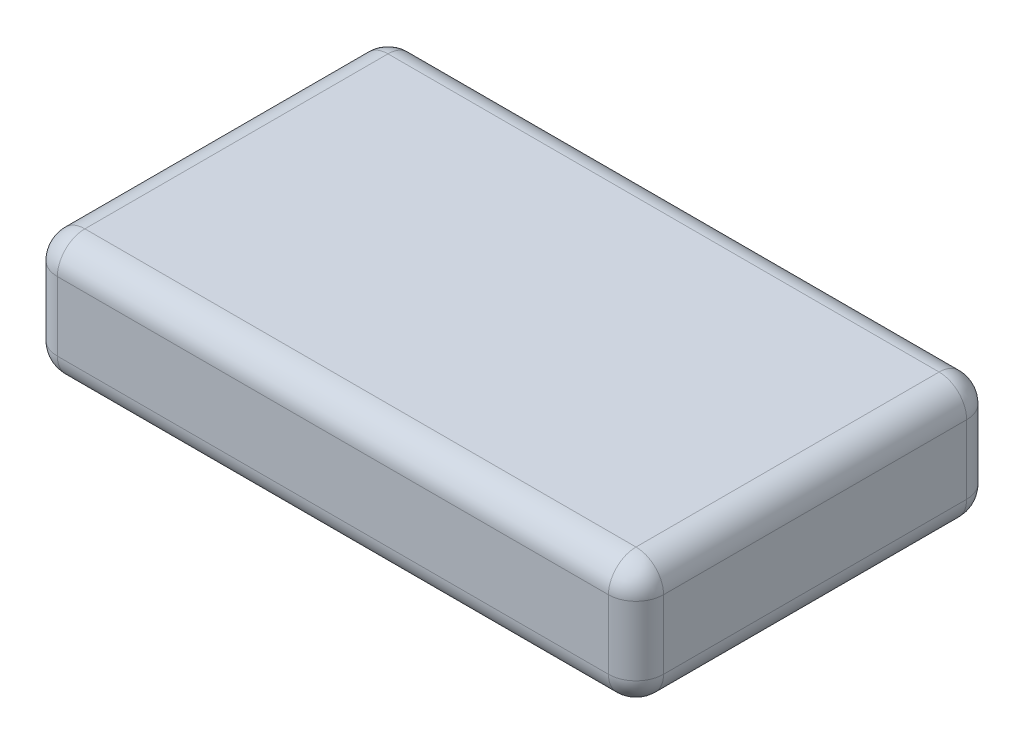
ISO-10303-21;
HEADER;
FILE_DESCRIPTION(('STEP AP214'),'2;1');
FILE_NAME('part.step','',(''),(''),'','','');
FILE_SCHEMA(('AUTOMOTIVE_DESIGN { 1 0 10303 214 1 1 1 1 }'));
ENDSEC;
DATA;
#1=APPLICATION_CONTEXT('core data for automotive mechanical design processes');
#2=APPLICATION_PROTOCOL_DEFINITION('international standard','automotive_design',2000,#1);
#3=PRODUCT_CONTEXT('',#1,'mechanical');
#4=PRODUCT('Part','Part','',(#3));
#5=PRODUCT_RELATED_PRODUCT_CATEGORY('part','',(#4));
#6=PRODUCT_DEFINITION_FORMATION('','',#4);
#7=PRODUCT_DEFINITION_CONTEXT('part definition',#1,'design');
#8=PRODUCT_DEFINITION('design','',#6,#7);
#9=PRODUCT_DEFINITION_SHAPE('','',#8);
#10=(LENGTH_UNIT() NAMED_UNIT(*) SI_UNIT(.MILLI.,.METRE.));
#11=(NAMED_UNIT(*) PLANE_ANGLE_UNIT() SI_UNIT($,.RADIAN.));
#12=(NAMED_UNIT(*) SI_UNIT($,.STERADIAN.) SOLID_ANGLE_UNIT());
#13=UNCERTAINTY_MEASURE_WITH_UNIT(LENGTH_MEASURE(1.E-05),#10,'distance_accuracy_value','');
#14=(GEOMETRIC_REPRESENTATION_CONTEXT(3) GLOBAL_UNCERTAINTY_ASSIGNED_CONTEXT((#13)) GLOBAL_UNIT_ASSIGNED_CONTEXT((#10,
#11,#12)) REPRESENTATION_CONTEXT('',''));
#15=CARTESIAN_POINT('',(0.,0.,0.));
#16=DIRECTION('',(0.,0.,1.));
#17=DIRECTION('',(1.,0.,0.));
#18=AXIS2_PLACEMENT_3D('',#15,#16,#17);
#19=CARTESIAN_POINT('',(-22.,9.,-13.));
#20=DIRECTION('',(1.,0.,0.));
#21=DIRECTION('',(0.,0.,-1.));
#22=AXIS2_PLACEMENT_3D('',#19,#20,#21);
#23=PLANE('',#22);
#24=DIRECTION('',(0.,-1.,0.));
#25=VECTOR('',#24,1.);
#26=CARTESIAN_POINT('',(-22.,9.,-11.));
#27=LINE('',#26,#25);
#28=CARTESIAN_POINT('',(-22.,7.,-11.));
#29=VERTEX_POINT('',#28);
#30=CARTESIAN_POINT('',(-22.,2.,-11.));
#31=VERTEX_POINT('',#30);
#32=EDGE_CURVE('E236',#29,#31,#27,.T.);
#33=ORIENTED_EDGE('',*,*,#32,.T.);
#34=DIRECTION('',(0.,0.,1.));
#35=VECTOR('',#34,1.);
#36=CARTESIAN_POINT('',(-22.,2.,13.));
#37=LINE('',#36,#35);
#38=CARTESIAN_POINT('',(-22.,2.,11.));
#39=VERTEX_POINT('',#38);
#40=EDGE_CURVE('E238',#31,#39,#37,.T.);
#41=ORIENTED_EDGE('',*,*,#40,.T.);
#42=DIRECTION('',(0.,-1.,0.));
#43=VECTOR('',#42,1.);
#44=CARTESIAN_POINT('',(-22.,9.,11.));
#45=LINE('',#44,#43);
#46=CARTESIAN_POINT('',(-22.,7.,11.));
#47=VERTEX_POINT('',#46);
#48=EDGE_CURVE('E219',#39,#47,#45,.F.);
#49=ORIENTED_EDGE('',*,*,#48,.T.);
#50=DIRECTION('',(0.,0.,1.));
#51=VECTOR('',#50,1.);
#52=CARTESIAN_POINT('',(-22.,7.,-13.));
#53=LINE('',#52,#51);
#54=EDGE_CURVE('E228',#47,#29,#53,.F.);
#55=ORIENTED_EDGE('',*,*,#54,.T.);
#56=EDGE_LOOP('',(#33,#41,#49,#55));
#57=FACE_BOUND('',#56,.T.);
#58=ADVANCED_FACE('F42',(#57),#23,.F.);
#59=CARTESIAN_POINT('',(22.,9.,13.));
#60=DIRECTION('',(0.,0.,-1.));
#61=DIRECTION('',(-1.,0.,0.));
#62=AXIS2_PLACEMENT_3D('',#59,#60,#61);
#63=PLANE('',#62);
#64=DIRECTION('',(0.,-1.,0.));
#65=VECTOR('',#64,1.);
#66=CARTESIAN_POINT('',(-20.,9.,13.));
#67=LINE('',#66,#65);
#68=CARTESIAN_POINT('',(-20.,7.,13.));
#69=VERTEX_POINT('',#68);
#70=CARTESIAN_POINT('',(-20.,2.,13.));
#71=VERTEX_POINT('',#70);
#72=EDGE_CURVE('E221',#69,#71,#67,.T.);
#73=ORIENTED_EDGE('',*,*,#72,.T.);
#74=DIRECTION('',(1.,0.,0.));
#75=VECTOR('',#74,1.);
#76=CARTESIAN_POINT('',(22.,2.,13.));
#77=LINE('',#76,#75);
#78=CARTESIAN_POINT('',(20.,2.,13.));
#79=VERTEX_POINT('',#78);
#80=EDGE_CURVE('E225',#71,#79,#77,.T.);
#81=ORIENTED_EDGE('',*,*,#80,.T.);
#82=DIRECTION('',(0.,-1.,0.));
#83=VECTOR('',#82,1.);
#84=CARTESIAN_POINT('',(20.,9.,13.));
#85=LINE('',#84,#83);
#86=CARTESIAN_POINT('',(20.,7.,13.));
#87=VERTEX_POINT('',#86);
#88=EDGE_CURVE('E226',#79,#87,#85,.F.);
#89=ORIENTED_EDGE('',*,*,#88,.T.);
#90=DIRECTION('',(1.,0.,0.));
#91=VECTOR('',#90,1.);
#92=CARTESIAN_POINT('',(22.,7.,13.));
#93=LINE('',#92,#91);
#94=EDGE_CURVE('E230',#87,#69,#93,.F.);
#95=ORIENTED_EDGE('',*,*,#94,.T.);
#96=EDGE_LOOP('',(#73,#81,#89,#95));
#97=FACE_BOUND('',#96,.T.);
#98=ADVANCED_FACE('F298',(#97),#63,.F.);
#99=CARTESIAN_POINT('',(22.,9.,-13.));
#100=DIRECTION('',(-1.,0.,0.));
#101=DIRECTION('',(0.,0.,1.));
#102=AXIS2_PLACEMENT_3D('',#99,#100,#101);
#103=PLANE('',#102);
#104=DIRECTION('',(0.,-1.,0.));
#105=VECTOR('',#104,1.);
#106=CARTESIAN_POINT('',(22.,9.,11.));
#107=LINE('',#106,#105);
#108=CARTESIAN_POINT('',(22.,7.,11.));
#109=VERTEX_POINT('',#108);
#110=CARTESIAN_POINT('',(22.,2.,11.));
#111=VERTEX_POINT('',#110);
#112=EDGE_CURVE('E144',#109,#111,#107,.T.);
#113=ORIENTED_EDGE('',*,*,#112,.T.);
#114=DIRECTION('',(0.,0.,-1.));
#115=VECTOR('',#114,1.);
#116=CARTESIAN_POINT('',(22.,2.,-13.));
#117=LINE('',#116,#115);
#118=CARTESIAN_POINT('',(22.,2.,-11.));
#119=VERTEX_POINT('',#118);
#120=EDGE_CURVE('E140',#111,#119,#117,.T.);
#121=ORIENTED_EDGE('',*,*,#120,.T.);
#122=DIRECTION('',(0.,-1.,0.));
#123=VECTOR('',#122,1.);
#124=CARTESIAN_POINT('',(22.,9.,-11.));
#125=LINE('',#124,#123);
#126=CARTESIAN_POINT('',(22.,7.,-11.));
#127=VERTEX_POINT('',#126);
#128=EDGE_CURVE('E134',#119,#127,#125,.F.);
#129=ORIENTED_EDGE('',*,*,#128,.T.);
#130=DIRECTION('',(0.,0.,-1.));
#131=VECTOR('',#130,1.);
#132=CARTESIAN_POINT('',(22.,7.,-13.));
#133=LINE('',#132,#131);
#134=EDGE_CURVE('E137',#127,#109,#133,.F.);
#135=ORIENTED_EDGE('',*,*,#134,.T.);
#136=EDGE_LOOP('',(#113,#121,#129,#135));
#137=FACE_BOUND('',#136,.T.);
#138=ADVANCED_FACE('F136',(#137),#103,.F.);
#139=CARTESIAN_POINT('',(22.,9.,-13.));
#140=DIRECTION('',(0.,0.,1.));
#141=DIRECTION('',(1.,0.,0.));
#142=AXIS2_PLACEMENT_3D('',#139,#140,#141);
#143=PLANE('',#142);
#144=DIRECTION('',(0.,-1.,0.));
#145=VECTOR('',#144,1.);
#146=CARTESIAN_POINT('',(20.,9.,-13.));
#147=LINE('',#146,#145);
#148=CARTESIAN_POINT('',(20.,7.,-13.));
#149=VERTEX_POINT('',#148);
#150=CARTESIAN_POINT('',(20.,2.,-13.));
#151=VERTEX_POINT('',#150);
#152=EDGE_CURVE('E159',#149,#151,#147,.T.);
#153=ORIENTED_EDGE('',*,*,#152,.T.);
#154=DIRECTION('',(-1.,0.,0.));
#155=VECTOR('',#154,1.);
#156=CARTESIAN_POINT('',(-22.,2.,-13.));
#157=LINE('',#156,#155);
#158=CARTESIAN_POINT('',(-20.,2.,-13.));
#159=VERTEX_POINT('',#158);
#160=EDGE_CURVE('E245',#151,#159,#157,.T.);
#161=ORIENTED_EDGE('',*,*,#160,.T.);
#162=DIRECTION('',(0.,-1.,0.));
#163=VECTOR('',#162,1.);
#164=CARTESIAN_POINT('',(-20.,9.,-13.));
#165=LINE('',#164,#163);
#166=CARTESIAN_POINT('',(-20.,7.,-13.));
#167=VERTEX_POINT('',#166);
#168=EDGE_CURVE('E243',#159,#167,#165,.F.);
#169=ORIENTED_EDGE('',*,*,#168,.T.);
#170=DIRECTION('',(-1.,0.,0.));
#171=VECTOR('',#170,1.);
#172=CARTESIAN_POINT('',(22.,7.,-13.));
#173=LINE('',#172,#171);
#174=EDGE_CURVE('E240',#167,#149,#173,.F.);
#175=ORIENTED_EDGE('',*,*,#174,.T.);
#176=EDGE_LOOP('',(#153,#161,#169,#175));
#177=FACE_BOUND('',#176,.T.);
#178=ADVANCED_FACE('F305',(#177),#143,.F.);
#179=CARTESIAN_POINT('',(0.,9.,0.));
#180=DIRECTION('',(0.,-1.,0.));
#181=DIRECTION('',(0.,0.,-1.));
#182=AXIS2_PLACEMENT_3D('',#179,#180,#181);
#183=PLANE('',#182);
#184=DIRECTION('',(1.,0.,0.));
#185=VECTOR('',#184,1.);
#186=CARTESIAN_POINT('',(0.,9.,11.));
#187=LINE('',#186,#185);
#188=CARTESIAN_POINT('',(-20.,9.,11.));
#189=VERTEX_POINT('',#188);
#190=CARTESIAN_POINT('',(20.,9.,11.));
#191=VERTEX_POINT('',#190);
#192=EDGE_CURVE('E248',#189,#191,#187,.T.);
#193=ORIENTED_EDGE('',*,*,#192,.T.);
#194=DIRECTION('',(0.,0.,-1.));
#195=VECTOR('',#194,1.);
#196=CARTESIAN_POINT('',(20.,9.,0.));
#197=LINE('',#196,#195);
#198=CARTESIAN_POINT('',(20.,9.,-11.));
#199=VERTEX_POINT('',#198);
#200=EDGE_CURVE('E11',#191,#199,#197,.T.);
#201=ORIENTED_EDGE('',*,*,#200,.T.);
#202=DIRECTION('',(-1.,0.,0.));
#203=VECTOR('',#202,1.);
#204=CARTESIAN_POINT('',(0.,9.,-11.));
#205=LINE('',#204,#203);
#206=CARTESIAN_POINT('',(-20.,9.,-11.));
#207=VERTEX_POINT('',#206);
#208=EDGE_CURVE('E51',#199,#207,#205,.T.);
#209=ORIENTED_EDGE('',*,*,#208,.T.);
#210=DIRECTION('',(0.,0.,1.));
#211=VECTOR('',#210,1.);
#212=CARTESIAN_POINT('',(-20.,9.,0.));
#213=LINE('',#212,#211);
#214=EDGE_CURVE('E250',#207,#189,#213,.T.);
#215=ORIENTED_EDGE('',*,*,#214,.T.);
#216=EDGE_LOOP('',(#193,#201,#209,#215));
#217=FACE_BOUND('',#216,.T.);
#218=ADVANCED_FACE('F373',(#217),#183,.F.);
#219=CARTESIAN_POINT('',(0.,0.,0.));
#220=DIRECTION('',(0.,-1.,0.));
#221=DIRECTION('',(0.,0.,-1.));
#222=AXIS2_PLACEMENT_3D('',#219,#220,#221);
#223=PLANE('',#222);
#224=DIRECTION('',(-1.,0.,0.));
#225=VECTOR('',#224,1.);
#226=CARTESIAN_POINT('',(22.,0.,-11.));
#227=LINE('',#226,#225);
#228=CARTESIAN_POINT('',(-20.,0.,-11.));
#229=VERTEX_POINT('',#228);
#230=CARTESIAN_POINT('',(20.,0.,-11.));
#231=VERTEX_POINT('',#230);
#232=EDGE_CURVE('E285',#229,#231,#227,.F.);
#233=ORIENTED_EDGE('',*,*,#232,.T.);
#234=DIRECTION('',(0.,0.,-1.));
#235=VECTOR('',#234,1.);
#236=CARTESIAN_POINT('',(20.,0.,13.));
#237=LINE('',#236,#235);
#238=CARTESIAN_POINT('',(20.,0.,11.));
#239=VERTEX_POINT('',#238);
#240=EDGE_CURVE('E279',#231,#239,#237,.F.);
#241=ORIENTED_EDGE('',*,*,#240,.T.);
#242=DIRECTION('',(1.,0.,0.));
#243=VECTOR('',#242,1.);
#244=CARTESIAN_POINT('',(-22.,0.,11.));
#245=LINE('',#244,#243);
#246=CARTESIAN_POINT('',(-20.,0.,11.));
#247=VERTEX_POINT('',#246);
#248=EDGE_CURVE('E274',#239,#247,#245,.F.);
#249=ORIENTED_EDGE('',*,*,#248,.T.);
#250=DIRECTION('',(0.,0.,1.));
#251=VECTOR('',#250,1.);
#252=CARTESIAN_POINT('',(-20.,0.,-13.));
#253=LINE('',#252,#251);
#254=EDGE_CURVE('E280',#247,#229,#253,.F.);
#255=ORIENTED_EDGE('',*,*,#254,.T.);
#256=EDGE_LOOP('',(#233,#241,#249,#255));
#257=FACE_BOUND('',#256,.T.);
#258=ADVANCED_FACE('F283',(#257),#223,.T.);
#259=CARTESIAN_POINT('',(-20.,7.,0.));
#260=DIRECTION('',(0.,0.,1.));
#261=DIRECTION('',(1.,0.,0.));
#262=AXIS2_PLACEMENT_3D('',#259,#260,#261);
#263=CYLINDRICAL_SURFACE('',#262,2.);
#264=CARTESIAN_POINT('',(-20.,7.,11.));
#265=DIRECTION('',(0.,0.,1.));
#266=DIRECTION('',(1.,0.,0.));
#267=AXIS2_PLACEMENT_3D('',#264,#265,#266);
#268=CIRCLE('',#267,2.);
#269=EDGE_CURVE('E46',#189,#47,#268,.T.);
#270=ORIENTED_EDGE('',*,*,#269,.F.);
#271=ORIENTED_EDGE('',*,*,#214,.F.);
#272=CARTESIAN_POINT('',(-20.,7.,-11.));
#273=DIRECTION('',(0.,0.,-1.));
#274=DIRECTION('',(-1.,0.,0.));
#275=AXIS2_PLACEMENT_3D('',#272,#273,#274);
#276=CIRCLE('',#275,2.);
#277=EDGE_CURVE('E199',#29,#207,#276,.T.);
#278=ORIENTED_EDGE('',*,*,#277,.F.);
#279=ORIENTED_EDGE('',*,*,#54,.F.);
#280=EDGE_LOOP('',(#270,#271,#278,#279));
#281=FACE_BOUND('',#280,.T.);
#282=ADVANCED_FACE('F44',(#281),#263,.T.);
#283=CARTESIAN_POINT('',(-20.,7.,11.));
#284=DIRECTION('',(-1.,0.,0.));
#285=DIRECTION('',(0.,0.,1.));
#286=AXIS2_PLACEMENT_3D('',#283,#284,#285);
#287=SPHERICAL_SURFACE('',#286,2.);
#288=CARTESIAN_POINT('',(-20.,7.,11.));
#289=DIRECTION('',(-1.,0.,0.));
#290=DIRECTION('',(0.,0.,1.));
#291=AXIS2_PLACEMENT_3D('',#288,#289,#290);
#292=CIRCLE('',#291,2.);
#293=EDGE_CURVE('E194',#189,#69,#292,.F.);
#294=ORIENTED_EDGE('',*,*,#293,.F.);
#295=ORIENTED_EDGE('',*,*,#269,.T.);
#296=CARTESIAN_POINT('',(-20.,7.,11.));
#297=DIRECTION('',(0.,1.,0.));
#298=DIRECTION('',(0.,0.,1.));
#299=AXIS2_PLACEMENT_3D('',#296,#297,#298);
#300=CIRCLE('',#299,2.);
#301=EDGE_CURVE('E197',#69,#47,#300,.F.);
#302=ORIENTED_EDGE('',*,*,#301,.F.);
#303=EDGE_LOOP('',(#294,#295,#302));
#304=FACE_BOUND('',#303,.T.);
#305=ADVANCED_FACE('F210',(#304),#287,.T.);
#306=CARTESIAN_POINT('',(-20.,7.,-11.));
#307=DIRECTION('',(0.,1.,0.));
#308=DIRECTION('',(-1.,0.,0.));
#309=AXIS2_PLACEMENT_3D('',#306,#307,#308);
#310=SPHERICAL_SURFACE('',#309,2.);
#311=CARTESIAN_POINT('',(-20.,7.,-11.));
#312=DIRECTION('',(0.,1.,0.));
#313=DIRECTION('',(0.,0.,1.));
#314=AXIS2_PLACEMENT_3D('',#311,#312,#313);
#315=CIRCLE('',#314,2.);
#316=EDGE_CURVE('E188',#29,#167,#315,.F.);
#317=ORIENTED_EDGE('',*,*,#316,.F.);
#318=ORIENTED_EDGE('',*,*,#277,.T.);
#319=CARTESIAN_POINT('',(-20.,7.,-11.));
#320=DIRECTION('',(-1.,0.,0.));
#321=DIRECTION('',(0.,0.,1.));
#322=AXIS2_PLACEMENT_3D('',#319,#320,#321);
#323=CIRCLE('',#322,2.);
#324=EDGE_CURVE('E191',#167,#207,#323,.F.);
#325=ORIENTED_EDGE('',*,*,#324,.F.);
#326=EDGE_LOOP('',(#317,#318,#325));
#327=FACE_BOUND('',#326,.T.);
#328=ADVANCED_FACE('F364',(#327),#310,.T.);
#329=CARTESIAN_POINT('',(-20.,9.,11.));
#330=DIRECTION('',(0.,-1.,0.));
#331=DIRECTION('',(0.,0.,-1.));
#332=AXIS2_PLACEMENT_3D('',#329,#330,#331);
#333=CYLINDRICAL_SURFACE('',#332,2.);
#334=ORIENTED_EDGE('',*,*,#301,.T.);
#335=ORIENTED_EDGE('',*,*,#48,.F.);
#336=CARTESIAN_POINT('',(-20.,2.,11.));
#337=DIRECTION('',(0.,-1.,0.));
#338=DIRECTION('',(0.,0.,-1.));
#339=AXIS2_PLACEMENT_3D('',#336,#337,#338);
#340=CIRCLE('',#339,2.);
#341=EDGE_CURVE('E183',#71,#39,#340,.T.);
#342=ORIENTED_EDGE('',*,*,#341,.F.);
#343=ORIENTED_EDGE('',*,*,#72,.F.);
#344=EDGE_LOOP('',(#334,#335,#342,#343));
#345=FACE_BOUND('',#344,.T.);
#346=ADVANCED_FACE('F217',(#345),#333,.T.);
#347=CARTESIAN_POINT('',(0.,7.,11.));
#348=DIRECTION('',(1.,0.,0.));
#349=DIRECTION('',(0.,0.,-1.));
#350=AXIS2_PLACEMENT_3D('',#347,#348,#349);
#351=CYLINDRICAL_SURFACE('',#350,2.);
#352=ORIENTED_EDGE('',*,*,#293,.T.);
#353=ORIENTED_EDGE('',*,*,#94,.F.);
#354=CARTESIAN_POINT('',(20.,7.,11.));
#355=DIRECTION('',(1.,0.,0.));
#356=DIRECTION('',(0.,0.,-1.));
#357=AXIS2_PLACEMENT_3D('',#354,#355,#356);
#358=CIRCLE('',#357,2.);
#359=EDGE_CURVE('E180',#191,#87,#358,.T.);
#360=ORIENTED_EDGE('',*,*,#359,.F.);
#361=ORIENTED_EDGE('',*,*,#192,.F.);
#362=EDGE_LOOP('',(#352,#353,#360,#361));
#363=FACE_BOUND('',#362,.T.);
#364=ADVANCED_FACE('F358',(#363),#351,.T.);
#365=CARTESIAN_POINT('',(20.,7.,0.));
#366=DIRECTION('',(0.,0.,-1.));
#367=DIRECTION('',(-1.,0.,0.));
#368=AXIS2_PLACEMENT_3D('',#365,#366,#367);
#369=CYLINDRICAL_SURFACE('',#368,2.);
#370=CARTESIAN_POINT('',(20.,7.,-11.));
#371=DIRECTION('',(0.,0.,-1.));
#372=DIRECTION('',(-1.,0.,0.));
#373=AXIS2_PLACEMENT_3D('',#370,#371,#372);
#374=CIRCLE('',#373,2.);
#375=EDGE_CURVE('E149',#199,#127,#374,.T.);
#376=ORIENTED_EDGE('',*,*,#375,.F.);
#377=ORIENTED_EDGE('',*,*,#200,.F.);
#378=CARTESIAN_POINT('',(20.,7.,11.));
#379=DIRECTION('',(0.,0.,1.));
#380=DIRECTION('',(0.,-1.,0.));
#381=AXIS2_PLACEMENT_3D('',#378,#379,#380);
#382=CIRCLE('',#381,2.);
#383=EDGE_CURVE('E151',#109,#191,#382,.T.);
#384=ORIENTED_EDGE('',*,*,#383,.F.);
#385=ORIENTED_EDGE('',*,*,#134,.F.);
#386=EDGE_LOOP('',(#376,#377,#384,#385));
#387=FACE_BOUND('',#386,.T.);
#388=ADVANCED_FACE('F147',(#387),#369,.T.);
#389=CARTESIAN_POINT('',(0.,7.,-11.));
#390=DIRECTION('',(-1.,0.,0.));
#391=DIRECTION('',(0.,0.,1.));
#392=AXIS2_PLACEMENT_3D('',#389,#390,#391);
#393=CYLINDRICAL_SURFACE('',#392,2.);
#394=ORIENTED_EDGE('',*,*,#324,.T.);
#395=ORIENTED_EDGE('',*,*,#208,.F.);
#396=CARTESIAN_POINT('',(20.,7.,-11.));
#397=DIRECTION('',(1.,0.,0.));
#398=DIRECTION('',(0.,0.,-1.));
#399=AXIS2_PLACEMENT_3D('',#396,#397,#398);
#400=CIRCLE('',#399,2.);
#401=EDGE_CURVE('E59',#149,#199,#400,.T.);
#402=ORIENTED_EDGE('',*,*,#401,.F.);
#403=ORIENTED_EDGE('',*,*,#174,.F.);
#404=EDGE_LOOP('',(#394,#395,#402,#403));
#405=FACE_BOUND('',#404,.T.);
#406=ADVANCED_FACE('F351',(#405),#393,.T.);
#407=CARTESIAN_POINT('',(-20.,9.,-11.));
#408=DIRECTION('',(0.,-1.,0.));
#409=DIRECTION('',(0.,0.,-1.));
#410=AXIS2_PLACEMENT_3D('',#407,#408,#409);
#411=CYLINDRICAL_SURFACE('',#410,2.);
#412=ORIENTED_EDGE('',*,*,#316,.T.);
#413=ORIENTED_EDGE('',*,*,#168,.F.);
#414=CARTESIAN_POINT('',(-20.,2.,-11.));
#415=DIRECTION('',(0.,-1.,0.));
#416=DIRECTION('',(0.,0.,-1.));
#417=AXIS2_PLACEMENT_3D('',#414,#415,#416);
#418=CIRCLE('',#417,2.);
#419=EDGE_CURVE('E175',#31,#159,#418,.T.);
#420=ORIENTED_EDGE('',*,*,#419,.F.);
#421=ORIENTED_EDGE('',*,*,#32,.F.);
#422=EDGE_LOOP('',(#412,#413,#420,#421));
#423=FACE_BOUND('',#422,.T.);
#424=ADVANCED_FACE('F347',(#423),#411,.T.);
#425=CARTESIAN_POINT('',(-20.,2.,-13.));
#426=DIRECTION('',(0.,0.,-1.));
#427=DIRECTION('',(-1.,0.,0.));
#428=AXIS2_PLACEMENT_3D('',#425,#426,#427);
#429=CYLINDRICAL_SURFACE('',#428,2.);
#430=CARTESIAN_POINT('',(-20.,2.,11.));
#431=DIRECTION('',(0.,0.,1.));
#432=DIRECTION('',(1.,0.,0.));
#433=AXIS2_PLACEMENT_3D('',#430,#431,#432);
#434=CIRCLE('',#433,2.);
#435=EDGE_CURVE('E185',#39,#247,#434,.T.);
#436=ORIENTED_EDGE('',*,*,#435,.F.);
#437=ORIENTED_EDGE('',*,*,#40,.F.);
#438=CARTESIAN_POINT('',(-20.,2.,-11.));
#439=DIRECTION('',(0.,0.,-1.));
#440=DIRECTION('',(-1.,0.,0.));
#441=AXIS2_PLACEMENT_3D('',#438,#439,#440);
#442=CIRCLE('',#441,2.);
#443=EDGE_CURVE('E172',#229,#31,#442,.T.);
#444=ORIENTED_EDGE('',*,*,#443,.F.);
#445=ORIENTED_EDGE('',*,*,#254,.F.);
#446=EDGE_LOOP('',(#436,#437,#444,#445));
#447=FACE_BOUND('',#446,.T.);
#448=ADVANCED_FACE('F343',(#447),#429,.T.);
#449=CARTESIAN_POINT('',(-20.,2.,11.));
#450=DIRECTION('',(-1.,0.,0.));
#451=DIRECTION('',(0.,0.,1.));
#452=AXIS2_PLACEMENT_3D('',#449,#450,#451);
#453=SPHERICAL_SURFACE('',#452,2.);
#454=ORIENTED_EDGE('',*,*,#341,.T.);
#455=ORIENTED_EDGE('',*,*,#435,.T.);
#456=CARTESIAN_POINT('',(-20.,2.,11.));
#457=DIRECTION('',(-1.,0.,0.));
#458=DIRECTION('',(0.,0.,1.));
#459=AXIS2_PLACEMENT_3D('',#456,#457,#458);
#460=CIRCLE('',#459,2.);
#461=EDGE_CURVE('E164',#71,#247,#460,.F.);
#462=ORIENTED_EDGE('',*,*,#461,.F.);
#463=EDGE_LOOP('',(#454,#455,#462));
#464=FACE_BOUND('',#463,.T.);
#465=ADVANCED_FACE('F339',(#464),#453,.T.);
#466=CARTESIAN_POINT('',(20.,7.,11.));
#467=DIRECTION('',(0.,1.,0.));
#468=DIRECTION('',(0.,0.,1.));
#469=AXIS2_PLACEMENT_3D('',#466,#467,#468);
#470=SPHERICAL_SURFACE('',#469,2.);
#471=ORIENTED_EDGE('',*,*,#383,.T.);
#472=ORIENTED_EDGE('',*,*,#359,.T.);
#473=CARTESIAN_POINT('',(20.,7.,11.));
#474=DIRECTION('',(0.,1.,0.));
#475=DIRECTION('',(0.,0.,1.));
#476=AXIS2_PLACEMENT_3D('',#473,#474,#475);
#477=CIRCLE('',#476,2.);
#478=EDGE_CURVE('E160',#109,#87,#477,.F.);
#479=ORIENTED_EDGE('',*,*,#478,.F.);
#480=EDGE_LOOP('',(#471,#472,#479));
#481=FACE_BOUND('',#480,.T.);
#482=ADVANCED_FACE('F336',(#481),#470,.T.);
#483=CARTESIAN_POINT('',(20.,7.,-11.));
#484=DIRECTION('',(0.,1.,0.));
#485=DIRECTION('',(0.,0.,1.));
#486=AXIS2_PLACEMENT_3D('',#483,#484,#485);
#487=SPHERICAL_SURFACE('',#486,2.);
#488=ORIENTED_EDGE('',*,*,#401,.T.);
#489=ORIENTED_EDGE('',*,*,#375,.T.);
#490=CARTESIAN_POINT('',(20.,7.,-11.));
#491=DIRECTION('',(0.,1.,0.));
#492=DIRECTION('',(0.,0.,1.));
#493=AXIS2_PLACEMENT_3D('',#490,#491,#492);
#494=CIRCLE('',#493,2.);
#495=EDGE_CURVE('E155',#149,#127,#494,.F.);
#496=ORIENTED_EDGE('',*,*,#495,.F.);
#497=EDGE_LOOP('',(#488,#489,#496));
#498=FACE_BOUND('',#497,.T.);
#499=ADVANCED_FACE('F154',(#498),#487,.T.);
#500=CARTESIAN_POINT('',(-20.,2.,-11.));
#501=DIRECTION('',(-1.,0.,0.));
#502=DIRECTION('',(0.,0.,1.));
#503=AXIS2_PLACEMENT_3D('',#500,#501,#502);
#504=SPHERICAL_SURFACE('',#503,2.);
#505=ORIENTED_EDGE('',*,*,#443,.T.);
#506=ORIENTED_EDGE('',*,*,#419,.T.);
#507=CARTESIAN_POINT('',(-20.,2.,-11.));
#508=DIRECTION('',(-1.,0.,0.));
#509=DIRECTION('',(0.,0.,1.));
#510=AXIS2_PLACEMENT_3D('',#507,#508,#509);
#511=CIRCLE('',#510,2.);
#512=EDGE_CURVE('E161',#229,#159,#511,.F.);
#513=ORIENTED_EDGE('',*,*,#512,.F.);
#514=EDGE_LOOP('',(#505,#506,#513));
#515=FACE_BOUND('',#514,.T.);
#516=ADVANCED_FACE('F330',(#515),#504,.T.);
#517=CARTESIAN_POINT('',(22.,2.,11.));
#518=DIRECTION('',(-1.,0.,0.));
#519=DIRECTION('',(0.,0.,1.));
#520=AXIS2_PLACEMENT_3D('',#517,#518,#519);
#521=CYLINDRICAL_SURFACE('',#520,2.);
#522=ORIENTED_EDGE('',*,*,#461,.T.);
#523=ORIENTED_EDGE('',*,*,#248,.F.);
#524=CARTESIAN_POINT('',(20.,2.,11.));
#525=DIRECTION('',(1.,0.,0.));
#526=DIRECTION('',(0.,0.,-1.));
#527=AXIS2_PLACEMENT_3D('',#524,#525,#526);
#528=CIRCLE('',#527,2.);
#529=EDGE_CURVE('E166',#79,#239,#528,.T.);
#530=ORIENTED_EDGE('',*,*,#529,.F.);
#531=ORIENTED_EDGE('',*,*,#80,.F.);
#532=EDGE_LOOP('',(#522,#523,#530,#531));
#533=FACE_BOUND('',#532,.T.);
#534=ADVANCED_FACE('F276',(#533),#521,.T.);
#535=CARTESIAN_POINT('',(20.,9.,11.));
#536=DIRECTION('',(0.,-1.,0.));
#537=DIRECTION('',(0.,0.,-1.));
#538=AXIS2_PLACEMENT_3D('',#535,#536,#537);
#539=CYLINDRICAL_SURFACE('',#538,2.);
#540=ORIENTED_EDGE('',*,*,#478,.T.);
#541=ORIENTED_EDGE('',*,*,#88,.F.);
#542=CARTESIAN_POINT('',(20.,2.,11.));
#543=DIRECTION('',(0.,-1.,0.));
#544=DIRECTION('',(0.,0.,-1.));
#545=AXIS2_PLACEMENT_3D('',#542,#543,#544);
#546=CIRCLE('',#545,2.);
#547=EDGE_CURVE('E263',#111,#79,#546,.T.);
#548=ORIENTED_EDGE('',*,*,#547,.F.);
#549=ORIENTED_EDGE('',*,*,#112,.F.);
#550=EDGE_LOOP('',(#540,#541,#548,#549));
#551=FACE_BOUND('',#550,.T.);
#552=ADVANCED_FACE('F296',(#551),#539,.T.);
#553=CARTESIAN_POINT('',(20.,9.,-11.));
#554=DIRECTION('',(0.,-1.,0.));
#555=DIRECTION('',(0.,0.,-1.));
#556=AXIS2_PLACEMENT_3D('',#553,#554,#555);
#557=CYLINDRICAL_SURFACE('',#556,2.);
#558=ORIENTED_EDGE('',*,*,#495,.T.);
#559=ORIENTED_EDGE('',*,*,#128,.F.);
#560=CARTESIAN_POINT('',(20.,2.,-11.));
#561=DIRECTION('',(0.,-1.,0.));
#562=DIRECTION('',(0.,0.,-1.));
#563=AXIS2_PLACEMENT_3D('',#560,#561,#562);
#564=CIRCLE('',#563,2.);
#565=EDGE_CURVE('E260',#151,#119,#564,.T.);
#566=ORIENTED_EDGE('',*,*,#565,.F.);
#567=ORIENTED_EDGE('',*,*,#152,.F.);
#568=EDGE_LOOP('',(#558,#559,#566,#567));
#569=FACE_BOUND('',#568,.T.);
#570=ADVANCED_FACE('F158',(#569),#557,.T.);
#571=CARTESIAN_POINT('',(22.,2.,-11.));
#572=DIRECTION('',(1.,0.,0.));
#573=DIRECTION('',(0.,0.,-1.));
#574=AXIS2_PLACEMENT_3D('',#571,#572,#573);
#575=CYLINDRICAL_SURFACE('',#574,2.);
#576=ORIENTED_EDGE('',*,*,#512,.T.);
#577=ORIENTED_EDGE('',*,*,#160,.F.);
#578=CARTESIAN_POINT('',(20.,2.,-11.));
#579=DIRECTION('',(1.,0.,0.));
#580=DIRECTION('',(0.,0.,-1.));
#581=AXIS2_PLACEMENT_3D('',#578,#579,#580);
#582=CIRCLE('',#581,2.);
#583=EDGE_CURVE('E257',#231,#151,#582,.T.);
#584=ORIENTED_EDGE('',*,*,#583,.F.);
#585=ORIENTED_EDGE('',*,*,#232,.F.);
#586=EDGE_LOOP('',(#576,#577,#584,#585));
#587=FACE_BOUND('',#586,.T.);
#588=ADVANCED_FACE('F320',(#587),#575,.T.);
#589=CARTESIAN_POINT('',(20.,2.,11.));
#590=DIRECTION('',(0.,0.,1.));
#591=DIRECTION('',(1.,0.,0.));
#592=AXIS2_PLACEMENT_3D('',#589,#590,#591);
#593=SPHERICAL_SURFACE('',#592,2.);
#594=ORIENTED_EDGE('',*,*,#547,.T.);
#595=ORIENTED_EDGE('',*,*,#529,.T.);
#596=CARTESIAN_POINT('',(20.,2.,11.));
#597=DIRECTION('',(0.,0.,1.));
#598=DIRECTION('',(1.,0.,0.));
#599=AXIS2_PLACEMENT_3D('',#596,#597,#598);
#600=CIRCLE('',#599,2.);
#601=EDGE_CURVE('E255',#111,#239,#600,.F.);
#602=ORIENTED_EDGE('',*,*,#601,.F.);
#603=EDGE_LOOP('',(#594,#595,#602));
#604=FACE_BOUND('',#603,.T.);
#605=ADVANCED_FACE('F269',(#604),#593,.T.);
#606=CARTESIAN_POINT('',(20.,2.,-11.));
#607=DIRECTION('',(0.,0.,-1.));
#608=DIRECTION('',(-1.,0.,0.));
#609=AXIS2_PLACEMENT_3D('',#606,#607,#608);
#610=SPHERICAL_SURFACE('',#609,2.);
#611=ORIENTED_EDGE('',*,*,#583,.T.);
#612=ORIENTED_EDGE('',*,*,#565,.T.);
#613=CARTESIAN_POINT('',(20.,2.,-11.));
#614=DIRECTION('',(0.,0.,-1.));
#615=DIRECTION('',(-1.,0.,0.));
#616=AXIS2_PLACEMENT_3D('',#613,#614,#615);
#617=CIRCLE('',#616,2.);
#618=EDGE_CURVE('E253',#231,#119,#617,.F.);
#619=ORIENTED_EDGE('',*,*,#618,.F.);
#620=EDGE_LOOP('',(#611,#612,#619));
#621=FACE_BOUND('',#620,.T.);
#622=ADVANCED_FACE('F314',(#621),#610,.T.);
#623=CARTESIAN_POINT('',(20.,2.,-13.));
#624=DIRECTION('',(0.,0.,1.));
#625=DIRECTION('',(1.,0.,0.));
#626=AXIS2_PLACEMENT_3D('',#623,#624,#625);
#627=CYLINDRICAL_SURFACE('',#626,2.);
#628=ORIENTED_EDGE('',*,*,#601,.T.);
#629=ORIENTED_EDGE('',*,*,#240,.F.);
#630=ORIENTED_EDGE('',*,*,#618,.T.);
#631=ORIENTED_EDGE('',*,*,#120,.F.);
#632=EDGE_LOOP('',(#628,#629,#630,#631));
#633=FACE_BOUND('',#632,.T.);
#634=ADVANCED_FACE('F311',(#633),#627,.T.);
#635=CLOSED_SHELL('',(#58,#98,#138,#178,#218,#258,#282,#305,#328,#346,#364,#388,#406,#424,#448,
#465,#482,#499,#516,#534,#552,#570,#588,#605,#622,#634));
#636=MANIFOLD_SOLID_BREP('B2',#635);
#637=ADVANCED_BREP_SHAPE_REPRESENTATION('',(#18,#636),#14);
#638=SHAPE_DEFINITION_REPRESENTATION(#9,#637);
ENDSEC;
END-ISO-10303-21;
